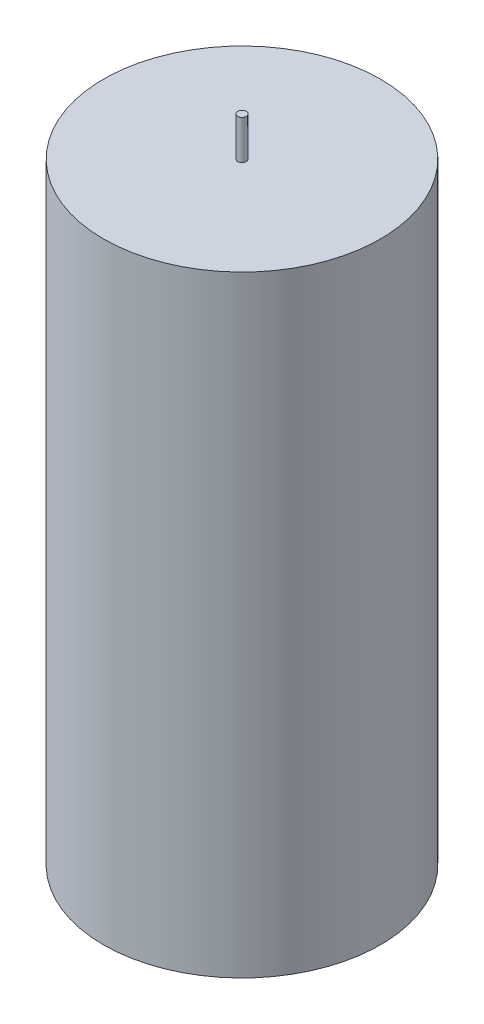
ISO-10303-21;
HEADER;
FILE_DESCRIPTION(('STEP AP214'),'2;1');
FILE_NAME('part.step','',(''),(''),'','','');
FILE_SCHEMA(('AUTOMOTIVE_DESIGN { 1 0 10303 214 1 1 1 1 }'));
ENDSEC;
DATA;
#1=APPLICATION_CONTEXT('core data for automotive mechanical design processes');
#2=APPLICATION_PROTOCOL_DEFINITION('international standard','automotive_design',2000,#1);
#3=PRODUCT_CONTEXT('',#1,'mechanical');
#4=PRODUCT('Part','Part','',(#3));
#5=PRODUCT_RELATED_PRODUCT_CATEGORY('part','',(#4));
#6=PRODUCT_DEFINITION_FORMATION('','',#4);
#7=PRODUCT_DEFINITION_CONTEXT('part definition',#1,'design');
#8=PRODUCT_DEFINITION('design','',#6,#7);
#9=PRODUCT_DEFINITION_SHAPE('','',#8);
#10=(LENGTH_UNIT() NAMED_UNIT(*) SI_UNIT(.MILLI.,.METRE.));
#11=(NAMED_UNIT(*) PLANE_ANGLE_UNIT() SI_UNIT($,.RADIAN.));
#12=(NAMED_UNIT(*) SI_UNIT($,.STERADIAN.) SOLID_ANGLE_UNIT());
#13=UNCERTAINTY_MEASURE_WITH_UNIT(LENGTH_MEASURE(1.E-05),#10,'distance_accuracy_value','');
#14=(GEOMETRIC_REPRESENTATION_CONTEXT(3) GLOBAL_UNCERTAINTY_ASSIGNED_CONTEXT((#13)) GLOBAL_UNIT_ASSIGNED_CONTEXT((#10,
#11,#12)) REPRESENTATION_CONTEXT('',''));
#15=CARTESIAN_POINT('',(0.,0.,0.));
#16=DIRECTION('',(0.,0.,1.));
#17=DIRECTION('',(1.,0.,0.));
#18=AXIS2_PLACEMENT_3D('',#15,#16,#17);
#19=CARTESIAN_POINT('',(0.,-199.2,0.));
#20=DIRECTION('',(0.,1.,0.));
#21=DIRECTION('',(0.,0.,1.));
#22=AXIS2_PLACEMENT_3D('',#19,#20,#21);
#23=PLANE('',#22);
#24=CARTESIAN_POINT('',(0.,-199.2,0.));
#25=DIRECTION('',(0.,1.,0.));
#26=DIRECTION('',(0.,0.,1.));
#27=AXIS2_PLACEMENT_3D('',#24,#25,#26);
#28=CIRCLE('',#27,2.50000000000005);
#29=CARTESIAN_POINT('',(0.,-199.2,2.50000000000005));
#30=VERTEX_POINT('',#29);
#31=EDGE_CURVE('E10',#30,#30,#28,.T.);
#32=ORIENTED_EDGE('',*,*,#31,.F.);
#33=EDGE_LOOP('',(#32));
#34=FACE_BOUND('',#33,.T.);
#35=ADVANCED_FACE('F33',(#34),#23,.F.);
#36=CARTESIAN_POINT('',(0.,415.253133909657,0.));
#37=DIRECTION('',(0.,1.,0.));
#38=DIRECTION('',(0.,0.,1.));
#39=AXIS2_PLACEMENT_3D('',#36,#37,#38);
#40=CYLINDRICAL_SURFACE('',#39,2.50000000000005);
#41=CARTESIAN_POINT('',(0.,-176.605,0.));
#42=DIRECTION('',(0.,1.,0.));
#43=DIRECTION('',(0.,0.,1.));
#44=AXIS2_PLACEMENT_3D('',#41,#42,#43);
#45=CIRCLE('',#44,2.50000000000005);
#46=CARTESIAN_POINT('',(0.,-176.605,2.50000000000005));
#47=VERTEX_POINT('',#46);
#48=EDGE_CURVE('E39',#47,#47,#45,.T.);
#49=ORIENTED_EDGE('',*,*,#48,.F.);
#50=EDGE_LOOP('',(#49));
#51=FACE_BOUND('',#50,.T.);
#52=ORIENTED_EDGE('',*,*,#31,.T.);
#53=EDGE_LOOP('',(#52));
#54=FACE_BOUND('',#53,.T.);
#55=ADVANCED_FACE('F75',(#51,#54),#40,.T.);
#56=CARTESIAN_POINT('',(0.,-176.605,0.));
#57=DIRECTION('',(0.,1.,0.));
#58=DIRECTION('',(0.,0.,1.));
#59=AXIS2_PLACEMENT_3D('',#56,#57,#58);
#60=PLANE('',#59);
#61=CARTESIAN_POINT('',(0.,-176.605,0.));
#62=DIRECTION('',(0.,1.,0.));
#63=DIRECTION('',(0.,0.,1.));
#64=AXIS2_PLACEMENT_3D('',#61,#62,#63);
#65=CIRCLE('',#64,80.);
#66=CARTESIAN_POINT('',(0.,-176.605,80.));
#67=VERTEX_POINT('',#66);
#68=EDGE_CURVE('E43',#67,#67,#65,.T.);
#69=ORIENTED_EDGE('',*,*,#68,.F.);
#70=EDGE_LOOP('',(#69));
#71=FACE_BOUND('',#70,.T.);
#72=ORIENTED_EDGE('',*,*,#48,.T.);
#73=EDGE_LOOP('',(#72));
#74=FACE_BOUND('',#73,.T.);
#75=ADVANCED_FACE('F80',(#71,#74),#60,.F.);
#76=CARTESIAN_POINT('',(0.,415.253133909657,0.));
#77=DIRECTION('',(0.,1.,0.));
#78=DIRECTION('',(0.,0.,1.));
#79=AXIS2_PLACEMENT_3D('',#76,#77,#78);
#80=CYLINDRICAL_SURFACE('',#79,80.);
#81=ORIENTED_EDGE('',*,*,#68,.T.);
#82=EDGE_LOOP('',(#81));
#83=FACE_BOUND('',#82,.T.);
#84=CARTESIAN_POINT('',(0.,176.605,0.));
#85=DIRECTION('',(0.,1.,0.));
#86=DIRECTION('',(0.,0.,1.));
#87=AXIS2_PLACEMENT_3D('',#84,#85,#86);
#88=CIRCLE('',#87,80.);
#89=CARTESIAN_POINT('',(0.,176.605,80.));
#90=VERTEX_POINT('',#89);
#91=EDGE_CURVE('E47',#90,#90,#88,.T.);
#92=ORIENTED_EDGE('',*,*,#91,.F.);
#93=EDGE_LOOP('',(#92));
#94=FACE_BOUND('',#93,.T.);
#95=ADVANCED_FACE('F71',(#83,#94),#80,.T.);
#96=CARTESIAN_POINT('',(0.,176.605,0.));
#97=DIRECTION('',(0.,1.,0.));
#98=DIRECTION('',(0.,0.,1.));
#99=AXIS2_PLACEMENT_3D('',#96,#97,#98);
#100=PLANE('',#99);
#101=ORIENTED_EDGE('',*,*,#91,.T.);
#102=EDGE_LOOP('',(#101));
#103=FACE_BOUND('',#102,.T.);
#104=CARTESIAN_POINT('',(0.,176.605,0.));
#105=DIRECTION('',(0.,1.,0.));
#106=DIRECTION('',(0.,0.,1.));
#107=AXIS2_PLACEMENT_3D('',#104,#105,#106);
#108=CIRCLE('',#107,2.5);
#109=CARTESIAN_POINT('',(0.,176.605,2.5));
#110=VERTEX_POINT('',#109);
#111=EDGE_CURVE('E52',#110,#110,#108,.T.);
#112=ORIENTED_EDGE('',*,*,#111,.F.);
#113=EDGE_LOOP('',(#112));
#114=FACE_BOUND('',#113,.T.);
#115=ADVANCED_FACE('F63',(#103,#114),#100,.T.);
#116=CARTESIAN_POINT('',(0.,415.253133909657,0.));
#117=DIRECTION('',(0.,1.,0.));
#118=DIRECTION('',(0.,0.,1.));
#119=AXIS2_PLACEMENT_3D('',#116,#117,#118);
#120=CYLINDRICAL_SURFACE('',#119,2.5);
#121=ORIENTED_EDGE('',*,*,#111,.T.);
#122=EDGE_LOOP('',(#121));
#123=FACE_BOUND('',#122,.T.);
#124=CARTESIAN_POINT('',(0.,199.2,0.));
#125=DIRECTION('',(0.,1.,0.));
#126=DIRECTION('',(0.,0.,1.));
#127=AXIS2_PLACEMENT_3D('',#124,#125,#126);
#128=CIRCLE('',#127,2.5);
#129=CARTESIAN_POINT('',(0.,199.2,2.5));
#130=VERTEX_POINT('',#129);
#131=EDGE_CURVE('E55',#130,#130,#128,.T.);
#132=ORIENTED_EDGE('',*,*,#131,.F.);
#133=EDGE_LOOP('',(#132));
#134=FACE_BOUND('',#133,.T.);
#135=ADVANCED_FACE('F61',(#123,#134),#120,.T.);
#136=CARTESIAN_POINT('',(0.,199.2,0.));
#137=DIRECTION('',(0.,1.,0.));
#138=DIRECTION('',(0.,0.,1.));
#139=AXIS2_PLACEMENT_3D('',#136,#137,#138);
#140=PLANE('',#139);
#141=ORIENTED_EDGE('',*,*,#131,.T.);
#142=EDGE_LOOP('',(#141));
#143=FACE_BOUND('',#142,.T.);
#144=ADVANCED_FACE('F59',(#143),#140,.T.);
#145=CLOSED_SHELL('',(#35,#55,#75,#95,#115,#135,#144));
#146=MANIFOLD_SOLID_BREP('B2',#145);
#147=ADVANCED_BREP_SHAPE_REPRESENTATION('',(#18,#146),#14);
#148=SHAPE_DEFINITION_REPRESENTATION(#9,#147);
ENDSEC;
END-ISO-10303-21;
